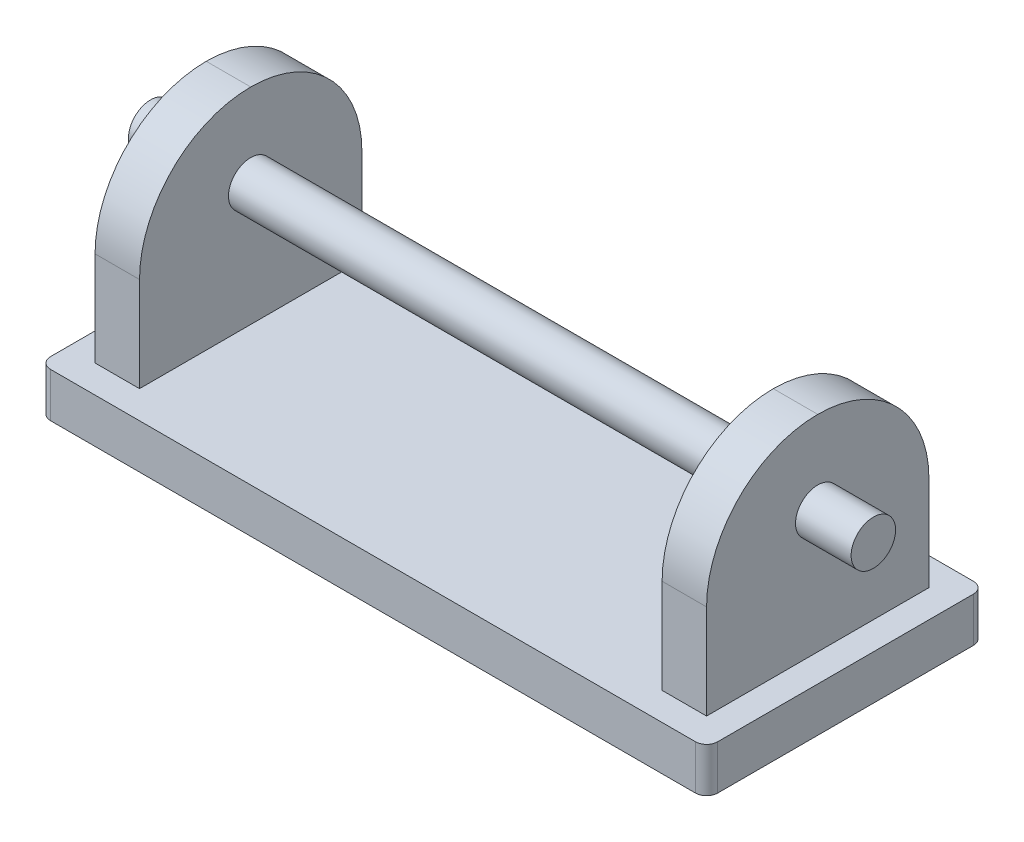
ISO-10303-21;
HEADER;
FILE_DESCRIPTION(('STEP AP214'),'2;1');
FILE_NAME('part.step','',(''),(''),'','','');
FILE_SCHEMA(('AUTOMOTIVE_DESIGN { 1 0 10303 214 1 1 1 1 }'));
ENDSEC;
DATA;
#1=APPLICATION_CONTEXT('core data for automotive mechanical design processes');
#2=APPLICATION_PROTOCOL_DEFINITION('international standard','automotive_design',2000,#1);
#3=PRODUCT_CONTEXT('',#1,'mechanical');
#4=PRODUCT('Part','Part','',(#3));
#5=PRODUCT_RELATED_PRODUCT_CATEGORY('part','',(#4));
#6=PRODUCT_DEFINITION_FORMATION('','',#4);
#7=PRODUCT_DEFINITION_CONTEXT('part definition',#1,'design');
#8=PRODUCT_DEFINITION('design','',#6,#7);
#9=PRODUCT_DEFINITION_SHAPE('','',#8);
#10=(LENGTH_UNIT() NAMED_UNIT(*) SI_UNIT(.MILLI.,.METRE.));
#11=(NAMED_UNIT(*) PLANE_ANGLE_UNIT() SI_UNIT($,.RADIAN.));
#12=(NAMED_UNIT(*) SI_UNIT($,.STERADIAN.) SOLID_ANGLE_UNIT());
#13=UNCERTAINTY_MEASURE_WITH_UNIT(LENGTH_MEASURE(1.E-05),#10,'distance_accuracy_value','');
#14=(GEOMETRIC_REPRESENTATION_CONTEXT(3) GLOBAL_UNCERTAINTY_ASSIGNED_CONTEXT((#13)) GLOBAL_UNIT_ASSIGNED_CONTEXT((#10,
#11,#12)) REPRESENTATION_CONTEXT('',''));
#15=CARTESIAN_POINT('',(0.,0.,0.));
#16=DIRECTION('',(0.,0.,1.));
#17=DIRECTION('',(1.,0.,0.));
#18=AXIS2_PLACEMENT_3D('',#15,#16,#17);
#19=CARTESIAN_POINT('',(0.,8.,0.));
#20=DIRECTION('',(0.,1.,0.));
#21=DIRECTION('',(0.,0.,1.));
#22=AXIS2_PLACEMENT_3D('',#19,#20,#21);
#23=PLANE('',#22);
#24=DIRECTION('',(0.,0.,1.));
#25=VECTOR('',#24,1.);
#26=CARTESIAN_POINT('',(-60.,8.,25.));
#27=LINE('',#26,#25);
#28=CARTESIAN_POINT('',(-60.,8.,-23.));
#29=VERTEX_POINT('',#28);
#30=CARTESIAN_POINT('',(-60.,8.,23.));
#31=VERTEX_POINT('',#30);
#32=EDGE_CURVE('E215',#29,#31,#27,.T.);
#33=ORIENTED_EDGE('',*,*,#32,.T.);
#34=CARTESIAN_POINT('',(-58.,8.,23.));
#35=DIRECTION('',(0.,1.,0.));
#36=DIRECTION('',(0.,0.,1.));
#37=AXIS2_PLACEMENT_3D('',#34,#35,#36);
#38=CIRCLE('',#37,2.);
#39=CARTESIAN_POINT('',(-58.,8.,25.));
#40=VERTEX_POINT('',#39);
#41=EDGE_CURVE('E293',#31,#40,#38,.T.);
#42=ORIENTED_EDGE('',*,*,#41,.T.);
#43=DIRECTION('',(1.,0.,0.));
#44=VECTOR('',#43,1.);
#45=CARTESIAN_POINT('',(60.,8.,25.));
#46=LINE('',#45,#44);
#47=CARTESIAN_POINT('',(58.,8.,25.));
#48=VERTEX_POINT('',#47);
#49=EDGE_CURVE('E218',#40,#48,#46,.T.);
#50=ORIENTED_EDGE('',*,*,#49,.T.);
#51=CARTESIAN_POINT('',(58.,8.,23.));
#52=DIRECTION('',(0.,1.,0.));
#53=DIRECTION('',(0.,0.,1.));
#54=AXIS2_PLACEMENT_3D('',#51,#52,#53);
#55=CIRCLE('',#54,2.);
#56=CARTESIAN_POINT('',(60.,8.,23.));
#57=VERTEX_POINT('',#56);
#58=EDGE_CURVE('E288',#48,#57,#55,.T.);
#59=ORIENTED_EDGE('',*,*,#58,.T.);
#60=DIRECTION('',(0.,0.,-1.));
#61=VECTOR('',#60,1.);
#62=CARTESIAN_POINT('',(60.,8.,25.));
#63=LINE('',#62,#61);
#64=CARTESIAN_POINT('',(60.,8.,-23.));
#65=VERTEX_POINT('',#64);
#66=EDGE_CURVE('E222',#57,#65,#63,.T.);
#67=ORIENTED_EDGE('',*,*,#66,.T.);
#68=CARTESIAN_POINT('',(58.,8.,-23.));
#69=DIRECTION('',(0.,1.,0.));
#70=DIRECTION('',(0.,0.,1.));
#71=AXIS2_PLACEMENT_3D('',#68,#69,#70);
#72=CIRCLE('',#71,2.);
#73=CARTESIAN_POINT('',(58.,8.,-25.));
#74=VERTEX_POINT('',#73);
#75=EDGE_CURVE('E55',#65,#74,#72,.T.);
#76=ORIENTED_EDGE('',*,*,#75,.T.);
#77=DIRECTION('',(-1.,0.,0.));
#78=VECTOR('',#77,1.);
#79=CARTESIAN_POINT('',(60.,8.,-25.));
#80=LINE('',#79,#78);
#81=CARTESIAN_POINT('',(-58.,8.,-25.));
#82=VERTEX_POINT('',#81);
#83=EDGE_CURVE('E224',#74,#82,#80,.T.);
#84=ORIENTED_EDGE('',*,*,#83,.T.);
#85=CARTESIAN_POINT('',(-58.,8.,-23.));
#86=DIRECTION('',(0.,1.,0.));
#87=DIRECTION('',(0.,0.,1.));
#88=AXIS2_PLACEMENT_3D('',#85,#86,#87);
#89=CIRCLE('',#88,2.);
#90=EDGE_CURVE('E291',#82,#29,#89,.T.);
#91=ORIENTED_EDGE('',*,*,#90,.T.);
#92=EDGE_LOOP('',(#33,#42,#50,#59,#67,#76,#84,#91));
#93=FACE_BOUND('',#92,.T.);
#94=DIRECTION('',(-1.,0.,0.));
#95=VECTOR('',#94,1.);
#96=CARTESIAN_POINT('',(-55.,8.,-20.));
#97=LINE('',#96,#95);
#98=CARTESIAN_POINT('',(-47.,8.,-20.));
#99=VERTEX_POINT('',#98);
#100=CARTESIAN_POINT('',(-55.,8.,-20.));
#101=VERTEX_POINT('',#100);
#102=EDGE_CURVE('E197',#99,#101,#97,.T.);
#103=ORIENTED_EDGE('',*,*,#102,.F.);
#104=DIRECTION('',(0.,0.,-1.));
#105=VECTOR('',#104,1.);
#106=CARTESIAN_POINT('',(-47.,8.,-20.));
#107=LINE('',#106,#105);
#108=CARTESIAN_POINT('',(-47.,8.,20.));
#109=VERTEX_POINT('',#108);
#110=EDGE_CURVE('E170',#109,#99,#107,.T.);
#111=ORIENTED_EDGE('',*,*,#110,.F.);
#112=DIRECTION('',(1.,0.,0.));
#113=VECTOR('',#112,1.);
#114=CARTESIAN_POINT('',(-55.,8.,20.));
#115=LINE('',#114,#113);
#116=CARTESIAN_POINT('',(-55.,8.,20.));
#117=VERTEX_POINT('',#116);
#118=EDGE_CURVE('E203',#117,#109,#115,.T.);
#119=ORIENTED_EDGE('',*,*,#118,.F.);
#120=DIRECTION('',(0.,0.,1.));
#121=VECTOR('',#120,1.);
#122=CARTESIAN_POINT('',(-55.,8.,-20.));
#123=LINE('',#122,#121);
#124=EDGE_CURVE('E200',#101,#117,#123,.T.);
#125=ORIENTED_EDGE('',*,*,#124,.F.);
#126=EDGE_LOOP('',(#103,#111,#119,#125));
#127=FACE_BOUND('',#126,.T.);
#128=DIRECTION('',(-1.,0.,0.));
#129=VECTOR('',#128,1.);
#130=CARTESIAN_POINT('',(47.,8.,-20.));
#131=LINE('',#130,#129);
#132=CARTESIAN_POINT('',(55.,8.,-20.));
#133=VERTEX_POINT('',#132);
#134=CARTESIAN_POINT('',(47.,8.,-20.));
#135=VERTEX_POINT('',#134);
#136=EDGE_CURVE('E165',#133,#135,#131,.T.);
#137=ORIENTED_EDGE('',*,*,#136,.F.);
#138=DIRECTION('',(0.,0.,-1.));
#139=VECTOR('',#138,1.);
#140=CARTESIAN_POINT('',(55.,8.,-20.));
#141=LINE('',#140,#139);
#142=CARTESIAN_POINT('',(55.,8.,20.));
#143=VERTEX_POINT('',#142);
#144=EDGE_CURVE('E174',#143,#133,#141,.T.);
#145=ORIENTED_EDGE('',*,*,#144,.F.);
#146=DIRECTION('',(1.,0.,0.));
#147=VECTOR('',#146,1.);
#148=CARTESIAN_POINT('',(47.,8.,20.));
#149=LINE('',#148,#147);
#150=CARTESIAN_POINT('',(47.,8.,20.));
#151=VERTEX_POINT('',#150);
#152=EDGE_CURVE('E186',#151,#143,#149,.T.);
#153=ORIENTED_EDGE('',*,*,#152,.F.);
#154=DIRECTION('',(0.,0.,1.));
#155=VECTOR('',#154,1.);
#156=CARTESIAN_POINT('',(47.,8.,-20.));
#157=LINE('',#156,#155);
#158=EDGE_CURVE('E184',#135,#151,#157,.T.);
#159=ORIENTED_EDGE('',*,*,#158,.F.);
#160=EDGE_LOOP('',(#137,#145,#153,#159));
#161=FACE_BOUND('',#160,.T.);
#162=ADVANCED_FACE('F33',(#93,#127,#161),#23,.T.);
#163=CARTESIAN_POINT('',(-60.,8.,25.));
#164=DIRECTION('',(1.,0.,0.));
#165=DIRECTION('',(0.,0.,-1.));
#166=AXIS2_PLACEMENT_3D('',#163,#164,#165);
#167=PLANE('',#166);
#168=DIRECTION('',(0.,0.,1.));
#169=VECTOR('',#168,1.);
#170=CARTESIAN_POINT('',(-60.,0.,25.));
#171=LINE('',#170,#169);
#172=CARTESIAN_POINT('',(-60.,0.,-23.));
#173=VERTEX_POINT('',#172);
#174=CARTESIAN_POINT('',(-60.,0.,23.));
#175=VERTEX_POINT('',#174);
#176=EDGE_CURVE('E214',#173,#175,#171,.T.);
#177=ORIENTED_EDGE('',*,*,#176,.T.);
#178=DIRECTION('',(0.,-1.,0.));
#179=VECTOR('',#178,1.);
#180=CARTESIAN_POINT('',(-60.,8.,23.));
#181=LINE('',#180,#179);
#182=EDGE_CURVE('E286',#175,#31,#181,.F.);
#183=ORIENTED_EDGE('',*,*,#182,.T.);
#184=ORIENTED_EDGE('',*,*,#32,.F.);
#185=DIRECTION('',(0.,-1.,0.));
#186=VECTOR('',#185,1.);
#187=CARTESIAN_POINT('',(-60.,8.,-23.));
#188=LINE('',#187,#186);
#189=EDGE_CURVE('E283',#29,#173,#188,.T.);
#190=ORIENTED_EDGE('',*,*,#189,.T.);
#191=EDGE_LOOP('',(#177,#183,#184,#190));
#192=FACE_BOUND('',#191,.T.);
#193=ADVANCED_FACE('F323',(#192),#167,.F.);
#194=CARTESIAN_POINT('',(60.,8.,25.));
#195=DIRECTION('',(0.,0.,-1.));
#196=DIRECTION('',(-1.,0.,0.));
#197=AXIS2_PLACEMENT_3D('',#194,#195,#196);
#198=PLANE('',#197);
#199=ORIENTED_EDGE('',*,*,#49,.F.);
#200=DIRECTION('',(0.,-1.,0.));
#201=VECTOR('',#200,1.);
#202=CARTESIAN_POINT('',(-58.,8.,25.));
#203=LINE('',#202,#201);
#204=CARTESIAN_POINT('',(-58.,0.,25.));
#205=VERTEX_POINT('',#204);
#206=EDGE_CURVE('E272',#40,#205,#203,.T.);
#207=ORIENTED_EDGE('',*,*,#206,.T.);
#208=DIRECTION('',(1.,0.,0.));
#209=VECTOR('',#208,1.);
#210=CARTESIAN_POINT('',(60.,0.,25.));
#211=LINE('',#210,#209);
#212=CARTESIAN_POINT('',(58.,0.,25.));
#213=VERTEX_POINT('',#212);
#214=EDGE_CURVE('E229',#205,#213,#211,.T.);
#215=ORIENTED_EDGE('',*,*,#214,.T.);
#216=DIRECTION('',(0.,-1.,0.));
#217=VECTOR('',#216,1.);
#218=CARTESIAN_POINT('',(58.,8.,25.));
#219=LINE('',#218,#217);
#220=EDGE_CURVE('E259',#213,#48,#219,.F.);
#221=ORIENTED_EDGE('',*,*,#220,.T.);
#222=EDGE_LOOP('',(#199,#207,#215,#221));
#223=FACE_BOUND('',#222,.T.);
#224=ADVANCED_FACE('F331',(#223),#198,.F.);
#225=CARTESIAN_POINT('',(60.,8.,25.));
#226=DIRECTION('',(-1.,0.,0.));
#227=DIRECTION('',(0.,0.,1.));
#228=AXIS2_PLACEMENT_3D('',#225,#226,#227);
#229=PLANE('',#228);
#230=DIRECTION('',(0.,0.,-1.));
#231=VECTOR('',#230,1.);
#232=CARTESIAN_POINT('',(60.,0.,25.));
#233=LINE('',#232,#231);
#234=CARTESIAN_POINT('',(60.,0.,23.));
#235=VERTEX_POINT('',#234);
#236=CARTESIAN_POINT('',(60.,0.,-23.));
#237=VERTEX_POINT('',#236);
#238=EDGE_CURVE('E232',#235,#237,#233,.T.);
#239=ORIENTED_EDGE('',*,*,#238,.T.);
#240=DIRECTION('',(0.,-1.,0.));
#241=VECTOR('',#240,1.);
#242=CARTESIAN_POINT('',(60.,8.,-23.));
#243=LINE('',#242,#241);
#244=EDGE_CURVE('E11',#237,#65,#243,.F.);
#245=ORIENTED_EDGE('',*,*,#244,.T.);
#246=ORIENTED_EDGE('',*,*,#66,.F.);
#247=DIRECTION('',(0.,-1.,0.));
#248=VECTOR('',#247,1.);
#249=CARTESIAN_POINT('',(60.,8.,23.));
#250=LINE('',#249,#248);
#251=EDGE_CURVE('E41',#57,#235,#250,.T.);
#252=ORIENTED_EDGE('',*,*,#251,.T.);
#253=EDGE_LOOP('',(#239,#245,#246,#252));
#254=FACE_BOUND('',#253,.T.);
#255=ADVANCED_FACE('F303',(#254),#229,.F.);
#256=CARTESIAN_POINT('',(60.,8.,-25.));
#257=DIRECTION('',(0.,0.,1.));
#258=DIRECTION('',(1.,0.,0.));
#259=AXIS2_PLACEMENT_3D('',#256,#257,#258);
#260=PLANE('',#259);
#261=DIRECTION('',(-1.,0.,0.));
#262=VECTOR('',#261,1.);
#263=CARTESIAN_POINT('',(60.,0.,-25.));
#264=LINE('',#263,#262);
#265=CARTESIAN_POINT('',(58.,0.,-25.));
#266=VERTEX_POINT('',#265);
#267=CARTESIAN_POINT('',(-58.,0.,-25.));
#268=VERTEX_POINT('',#267);
#269=EDGE_CURVE('E219',#266,#268,#264,.T.);
#270=ORIENTED_EDGE('',*,*,#269,.T.);
#271=DIRECTION('',(0.,-1.,0.));
#272=VECTOR('',#271,1.);
#273=CARTESIAN_POINT('',(-58.,8.,-25.));
#274=LINE('',#273,#272);
#275=EDGE_CURVE('E48',#268,#82,#274,.F.);
#276=ORIENTED_EDGE('',*,*,#275,.T.);
#277=ORIENTED_EDGE('',*,*,#83,.F.);
#278=DIRECTION('',(0.,-1.,0.));
#279=VECTOR('',#278,1.);
#280=CARTESIAN_POINT('',(58.,8.,-25.));
#281=LINE('',#280,#279);
#282=EDGE_CURVE('E295',#74,#266,#281,.T.);
#283=ORIENTED_EDGE('',*,*,#282,.T.);
#284=EDGE_LOOP('',(#270,#276,#277,#283));
#285=FACE_BOUND('',#284,.T.);
#286=ADVANCED_FACE('F314',(#285),#260,.F.);
#287=CARTESIAN_POINT('',(0.,0.,0.));
#288=DIRECTION('',(0.,1.,0.));
#289=DIRECTION('',(0.,0.,1.));
#290=AXIS2_PLACEMENT_3D('',#287,#288,#289);
#291=PLANE('',#290);
#292=ORIENTED_EDGE('',*,*,#214,.F.);
#293=CARTESIAN_POINT('',(-58.,0.,23.));
#294=DIRECTION('',(0.,1.,0.));
#295=DIRECTION('',(0.,0.,1.));
#296=AXIS2_PLACEMENT_3D('',#293,#294,#295);
#297=CIRCLE('',#296,2.);
#298=EDGE_CURVE('E281',#205,#175,#297,.F.);
#299=ORIENTED_EDGE('',*,*,#298,.T.);
#300=ORIENTED_EDGE('',*,*,#176,.F.);
#301=CARTESIAN_POINT('',(-58.,0.,-23.));
#302=DIRECTION('',(0.,1.,0.));
#303=DIRECTION('',(0.,0.,1.));
#304=AXIS2_PLACEMENT_3D('',#301,#302,#303);
#305=CIRCLE('',#304,2.);
#306=EDGE_CURVE('E279',#173,#268,#305,.F.);
#307=ORIENTED_EDGE('',*,*,#306,.T.);
#308=ORIENTED_EDGE('',*,*,#269,.F.);
#309=CARTESIAN_POINT('',(58.,0.,-23.));
#310=DIRECTION('',(0.,1.,0.));
#311=DIRECTION('',(0.,0.,1.));
#312=AXIS2_PLACEMENT_3D('',#309,#310,#311);
#313=CIRCLE('',#312,2.);
#314=EDGE_CURVE('E277',#266,#237,#313,.F.);
#315=ORIENTED_EDGE('',*,*,#314,.T.);
#316=ORIENTED_EDGE('',*,*,#238,.F.);
#317=CARTESIAN_POINT('',(58.,0.,23.));
#318=DIRECTION('',(0.,1.,0.));
#319=DIRECTION('',(0.,0.,1.));
#320=AXIS2_PLACEMENT_3D('',#317,#318,#319);
#321=CIRCLE('',#320,2.);
#322=EDGE_CURVE('E275',#235,#213,#321,.F.);
#323=ORIENTED_EDGE('',*,*,#322,.T.);
#324=EDGE_LOOP('',(#292,#299,#300,#307,#308,#315,#316,#323));
#325=FACE_BOUND('',#324,.T.);
#326=ADVANCED_FACE('F309',(#325),#291,.F.);
#327=CARTESIAN_POINT('',(-47.,45.,-20.));
#328=DIRECTION('',(-1.,0.,0.));
#329=DIRECTION('',(0.,0.,1.));
#330=AXIS2_PLACEMENT_3D('',#327,#328,#329);
#331=PLANE('',#330);
#332=CARTESIAN_POINT('',(-47.,30.,0.));
#333=DIRECTION('',(-1.,0.,0.));
#334=DIRECTION('',(0.,0.,1.));
#335=AXIS2_PLACEMENT_3D('',#332,#333,#334);
#336=CIRCLE('',#335,4.);
#337=CARTESIAN_POINT('',(-47.,30.,4.00000000000002));
#338=VERTEX_POINT('',#337);
#339=EDGE_CURVE('E265',#338,#338,#336,.T.);
#340=ORIENTED_EDGE('',*,*,#339,.T.);
#341=EDGE_LOOP('',(#340));
#342=FACE_BOUND('',#341,.T.);
#343=DIRECTION('',(0.,-1.,0.));
#344=VECTOR('',#343,1.);
#345=CARTESIAN_POINT('',(-47.,45.,-20.));
#346=LINE('',#345,#344);
#347=CARTESIAN_POINT('',(-47.,25.,-20.));
#348=VERTEX_POINT('',#347);
#349=EDGE_CURVE('E212',#348,#99,#346,.T.);
#350=ORIENTED_EDGE('',*,*,#349,.F.);
#351=CARTESIAN_POINT('',(-47.,25.,0.));
#352=DIRECTION('',(-1.,0.,0.));
#353=DIRECTION('',(0.,0.,1.));
#354=AXIS2_PLACEMENT_3D('',#351,#352,#353);
#355=CIRCLE('',#354,20.);
#356=CARTESIAN_POINT('',(-47.,45.,0.));
#357=VERTEX_POINT('',#356);
#358=EDGE_CURVE('E255',#348,#357,#355,.F.);
#359=ORIENTED_EDGE('',*,*,#358,.T.);
#360=CARTESIAN_POINT('',(-47.,25.,0.));
#361=DIRECTION('',(-1.,0.,0.));
#362=DIRECTION('',(0.,0.,1.));
#363=AXIS2_PLACEMENT_3D('',#360,#361,#362);
#364=CIRCLE('',#363,20.);
#365=CARTESIAN_POINT('',(-47.,25.,20.));
#366=VERTEX_POINT('',#365);
#367=EDGE_CURVE('E253',#357,#366,#364,.F.);
#368=ORIENTED_EDGE('',*,*,#367,.T.);
#369=DIRECTION('',(0.,-1.,0.));
#370=VECTOR('',#369,1.);
#371=CARTESIAN_POINT('',(-47.,45.,20.));
#372=LINE('',#371,#370);
#373=EDGE_CURVE('E206',#366,#109,#372,.T.);
#374=ORIENTED_EDGE('',*,*,#373,.T.);
#375=ORIENTED_EDGE('',*,*,#110,.T.);
#376=EDGE_LOOP('',(#350,#359,#368,#374,#375));
#377=FACE_BOUND('',#376,.T.);
#378=ADVANCED_FACE('F345',(#342,#377),#331,.F.);
#379=CARTESIAN_POINT('',(-55.,45.,-20.));
#380=DIRECTION('',(0.,0.,1.));
#381=DIRECTION('',(1.,0.,0.));
#382=AXIS2_PLACEMENT_3D('',#379,#380,#381);
#383=PLANE('',#382);
#384=DIRECTION('',(0.,-1.,0.));
#385=VECTOR('',#384,1.);
#386=CARTESIAN_POINT('',(-55.,45.,-20.));
#387=LINE('',#386,#385);
#388=CARTESIAN_POINT('',(-55.,25.,-20.));
#389=VERTEX_POINT('',#388);
#390=EDGE_CURVE('E210',#389,#101,#387,.T.);
#391=ORIENTED_EDGE('',*,*,#390,.F.);
#392=DIRECTION('',(-1.,0.,0.));
#393=VECTOR('',#392,1.);
#394=CARTESIAN_POINT('',(-47.,25.,-20.));
#395=LINE('',#394,#393);
#396=EDGE_CURVE('E250',#389,#348,#395,.F.);
#397=ORIENTED_EDGE('',*,*,#396,.T.);
#398=ORIENTED_EDGE('',*,*,#349,.T.);
#399=ORIENTED_EDGE('',*,*,#102,.T.);
#400=EDGE_LOOP('',(#391,#397,#398,#399));
#401=FACE_BOUND('',#400,.T.);
#402=ADVANCED_FACE('F511',(#401),#383,.F.);
#403=CARTESIAN_POINT('',(-55.,45.,-20.));
#404=DIRECTION('',(1.,0.,0.));
#405=DIRECTION('',(0.,0.,-1.));
#406=AXIS2_PLACEMENT_3D('',#403,#404,#405);
#407=PLANE('',#406);
#408=CARTESIAN_POINT('',(-55.,30.,0.));
#409=DIRECTION('',(1.,0.,0.));
#410=DIRECTION('',(0.,0.,-1.));
#411=AXIS2_PLACEMENT_3D('',#408,#409,#410);
#412=CIRCLE('',#411,4.);
#413=CARTESIAN_POINT('',(-55.,30.,-3.99999999999998));
#414=VERTEX_POINT('',#413);
#415=EDGE_CURVE('E595',#414,#414,#412,.T.);
#416=ORIENTED_EDGE('',*,*,#415,.T.);
#417=EDGE_LOOP('',(#416));
#418=FACE_BOUND('',#417,.T.);
#419=CARTESIAN_POINT('',(-55.,25.,0.));
#420=DIRECTION('',(1.,0.,0.));
#421=DIRECTION('',(0.,0.,-1.));
#422=AXIS2_PLACEMENT_3D('',#419,#420,#421);
#423=CIRCLE('',#422,20.);
#424=CARTESIAN_POINT('',(-55.,25.,20.));
#425=VERTEX_POINT('',#424);
#426=CARTESIAN_POINT('',(-55.,45.,0.));
#427=VERTEX_POINT('',#426);
#428=EDGE_CURVE('E246',#425,#427,#423,.F.);
#429=ORIENTED_EDGE('',*,*,#428,.T.);
#430=CARTESIAN_POINT('',(-55.,25.,0.));
#431=DIRECTION('',(1.,0.,0.));
#432=DIRECTION('',(0.,0.,-1.));
#433=AXIS2_PLACEMENT_3D('',#430,#431,#432);
#434=CIRCLE('',#433,20.);
#435=EDGE_CURVE('E248',#427,#389,#434,.F.);
#436=ORIENTED_EDGE('',*,*,#435,.T.);
#437=ORIENTED_EDGE('',*,*,#390,.T.);
#438=ORIENTED_EDGE('',*,*,#124,.T.);
#439=DIRECTION('',(0.,-1.,0.));
#440=VECTOR('',#439,1.);
#441=CARTESIAN_POINT('',(-55.,45.,20.));
#442=LINE('',#441,#440);
#443=EDGE_CURVE('E208',#425,#117,#442,.T.);
#444=ORIENTED_EDGE('',*,*,#443,.F.);
#445=EDGE_LOOP('',(#429,#436,#437,#438,#444));
#446=FACE_BOUND('',#445,.T.);
#447=ADVANCED_FACE('F502',(#418,#446),#407,.F.);
#448=CARTESIAN_POINT('',(-55.,45.,20.));
#449=DIRECTION('',(0.,0.,-1.));
#450=DIRECTION('',(-1.,0.,0.));
#451=AXIS2_PLACEMENT_3D('',#448,#449,#450);
#452=PLANE('',#451);
#453=ORIENTED_EDGE('',*,*,#373,.F.);
#454=DIRECTION('',(1.,0.,0.));
#455=VECTOR('',#454,1.);
#456=CARTESIAN_POINT('',(-55.,25.,20.));
#457=LINE('',#456,#455);
#458=EDGE_CURVE('E257',#366,#425,#457,.F.);
#459=ORIENTED_EDGE('',*,*,#458,.T.);
#460=ORIENTED_EDGE('',*,*,#443,.T.);
#461=ORIENTED_EDGE('',*,*,#118,.T.);
#462=EDGE_LOOP('',(#453,#459,#460,#461));
#463=FACE_BOUND('',#462,.T.);
#464=ADVANCED_FACE('F493',(#463),#452,.F.);
#465=CARTESIAN_POINT('',(55.,45.,-20.));
#466=DIRECTION('',(-1.,0.,0.));
#467=DIRECTION('',(0.,0.,1.));
#468=AXIS2_PLACEMENT_3D('',#465,#466,#467);
#469=PLANE('',#468);
#470=CARTESIAN_POINT('',(55.,30.,0.));
#471=DIRECTION('',(-1.,0.,0.));
#472=DIRECTION('',(0.,0.,1.));
#473=AXIS2_PLACEMENT_3D('',#470,#471,#472);
#474=CIRCLE('',#473,4.);
#475=CARTESIAN_POINT('',(55.,30.,3.99999999999998));
#476=VERTEX_POINT('',#475);
#477=EDGE_CURVE('E269',#476,#476,#474,.T.);
#478=ORIENTED_EDGE('',*,*,#477,.T.);
#479=EDGE_LOOP('',(#478));
#480=FACE_BOUND('',#479,.T.);
#481=DIRECTION('',(0.,-1.,0.));
#482=VECTOR('',#481,1.);
#483=CARTESIAN_POINT('',(55.,45.,-20.));
#484=LINE('',#483,#482);
#485=CARTESIAN_POINT('',(55.,25.,-20.));
#486=VERTEX_POINT('',#485);
#487=EDGE_CURVE('E160',#486,#133,#484,.T.);
#488=ORIENTED_EDGE('',*,*,#487,.F.);
#489=CARTESIAN_POINT('',(55.,25.,0.));
#490=DIRECTION('',(-1.,0.,0.));
#491=DIRECTION('',(0.,0.,1.));
#492=AXIS2_PLACEMENT_3D('',#489,#490,#491);
#493=CIRCLE('',#492,20.);
#494=CARTESIAN_POINT('',(55.,45.,0.));
#495=VERTEX_POINT('',#494);
#496=EDGE_CURVE('E242',#486,#495,#493,.F.);
#497=ORIENTED_EDGE('',*,*,#496,.T.);
#498=CARTESIAN_POINT('',(55.,25.,0.));
#499=DIRECTION('',(-1.,0.,0.));
#500=DIRECTION('',(0.,0.,1.));
#501=AXIS2_PLACEMENT_3D('',#498,#499,#500);
#502=CIRCLE('',#501,20.);
#503=CARTESIAN_POINT('',(55.,25.,20.));
#504=VERTEX_POINT('',#503);
#505=EDGE_CURVE('E240',#495,#504,#502,.F.);
#506=ORIENTED_EDGE('',*,*,#505,.T.);
#507=DIRECTION('',(0.,-1.,0.));
#508=VECTOR('',#507,1.);
#509=CARTESIAN_POINT('',(55.,45.,20.));
#510=LINE('',#509,#508);
#511=EDGE_CURVE('E177',#504,#143,#510,.T.);
#512=ORIENTED_EDGE('',*,*,#511,.T.);
#513=ORIENTED_EDGE('',*,*,#144,.T.);
#514=EDGE_LOOP('',(#488,#497,#506,#512,#513));
#515=FACE_BOUND('',#514,.T.);
#516=ADVANCED_FACE('F175',(#480,#515),#469,.F.);
#517=CARTESIAN_POINT('',(47.,45.,-20.));
#518=DIRECTION('',(0.,0.,1.));
#519=DIRECTION('',(1.,0.,0.));
#520=AXIS2_PLACEMENT_3D('',#517,#518,#519);
#521=PLANE('',#520);
#522=DIRECTION('',(0.,-1.,0.));
#523=VECTOR('',#522,1.);
#524=CARTESIAN_POINT('',(47.,45.,-20.));
#525=LINE('',#524,#523);
#526=CARTESIAN_POINT('',(47.,25.,-20.));
#527=VERTEX_POINT('',#526);
#528=EDGE_CURVE('E171',#527,#135,#525,.T.);
#529=ORIENTED_EDGE('',*,*,#528,.F.);
#530=DIRECTION('',(-1.,0.,0.));
#531=VECTOR('',#530,1.);
#532=CARTESIAN_POINT('',(55.,25.,-20.));
#533=LINE('',#532,#531);
#534=EDGE_CURVE('E168',#527,#486,#533,.F.);
#535=ORIENTED_EDGE('',*,*,#534,.T.);
#536=ORIENTED_EDGE('',*,*,#487,.T.);
#537=ORIENTED_EDGE('',*,*,#136,.T.);
#538=EDGE_LOOP('',(#529,#535,#536,#537));
#539=FACE_BOUND('',#538,.T.);
#540=ADVANCED_FACE('F163',(#539),#521,.F.);
#541=CARTESIAN_POINT('',(47.,45.,-20.));
#542=DIRECTION('',(1.,0.,0.));
#543=DIRECTION('',(0.,0.,-1.));
#544=AXIS2_PLACEMENT_3D('',#541,#542,#543);
#545=PLANE('',#544);
#546=CARTESIAN_POINT('',(47.,30.,0.));
#547=DIRECTION('',(1.,0.,0.));
#548=DIRECTION('',(0.,0.,-1.));
#549=AXIS2_PLACEMENT_3D('',#546,#547,#548);
#550=CIRCLE('',#549,4.);
#551=CARTESIAN_POINT('',(47.,30.,-4.00000000000002));
#552=VERTEX_POINT('',#551);
#553=EDGE_CURVE('E266',#552,#552,#550,.T.);
#554=ORIENTED_EDGE('',*,*,#553,.T.);
#555=EDGE_LOOP('',(#554));
#556=FACE_BOUND('',#555,.T.);
#557=CARTESIAN_POINT('',(47.,25.,0.));
#558=DIRECTION('',(1.,0.,0.));
#559=DIRECTION('',(0.,0.,-1.));
#560=AXIS2_PLACEMENT_3D('',#557,#558,#559);
#561=CIRCLE('',#560,20.);
#562=CARTESIAN_POINT('',(47.,25.,20.));
#563=VERTEX_POINT('',#562);
#564=CARTESIAN_POINT('',(47.,45.,0.));
#565=VERTEX_POINT('',#564);
#566=EDGE_CURVE('E226',#563,#565,#561,.F.);
#567=ORIENTED_EDGE('',*,*,#566,.T.);
#568=CARTESIAN_POINT('',(47.,25.,0.));
#569=DIRECTION('',(1.,0.,0.));
#570=DIRECTION('',(0.,0.,-1.));
#571=AXIS2_PLACEMENT_3D('',#568,#569,#570);
#572=CIRCLE('',#571,20.);
#573=EDGE_CURVE('E237',#565,#527,#572,.F.);
#574=ORIENTED_EDGE('',*,*,#573,.T.);
#575=ORIENTED_EDGE('',*,*,#528,.T.);
#576=ORIENTED_EDGE('',*,*,#158,.T.);
#577=DIRECTION('',(0.,-1.,0.));
#578=VECTOR('',#577,1.);
#579=CARTESIAN_POINT('',(47.,45.,20.));
#580=LINE('',#579,#578);
#581=EDGE_CURVE('E192',#563,#151,#580,.T.);
#582=ORIENTED_EDGE('',*,*,#581,.F.);
#583=EDGE_LOOP('',(#567,#574,#575,#576,#582));
#584=FACE_BOUND('',#583,.T.);
#585=ADVANCED_FACE('F469',(#556,#584),#545,.F.);
#586=CARTESIAN_POINT('',(47.,45.,20.));
#587=DIRECTION('',(0.,0.,-1.));
#588=DIRECTION('',(-1.,0.,0.));
#589=AXIS2_PLACEMENT_3D('',#586,#587,#588);
#590=PLANE('',#589);
#591=ORIENTED_EDGE('',*,*,#511,.F.);
#592=DIRECTION('',(1.,0.,0.));
#593=VECTOR('',#592,1.);
#594=CARTESIAN_POINT('',(47.,25.,20.));
#595=LINE('',#594,#593);
#596=EDGE_CURVE('E244',#504,#563,#595,.F.);
#597=ORIENTED_EDGE('',*,*,#596,.T.);
#598=ORIENTED_EDGE('',*,*,#581,.T.);
#599=ORIENTED_EDGE('',*,*,#152,.T.);
#600=EDGE_LOOP('',(#591,#597,#598,#599));
#601=FACE_BOUND('',#600,.T.);
#602=ADVANCED_FACE('F363',(#601),#590,.F.);
#603=CARTESIAN_POINT('',(0.,25.,0.));
#604=DIRECTION('',(-1.,0.,0.));
#605=DIRECTION('',(0.,0.,1.));
#606=AXIS2_PLACEMENT_3D('',#603,#604,#605);
#607=CYLINDRICAL_SURFACE('',#606,20.);
#608=ORIENTED_EDGE('',*,*,#596,.F.);
#609=ORIENTED_EDGE('',*,*,#505,.F.);
#610=DIRECTION('',(1.,0.,0.));
#611=VECTOR('',#610,1.);
#612=CARTESIAN_POINT('',(55.,45.,0.));
#613=LINE('',#612,#611);
#614=EDGE_CURVE('E181',#565,#495,#613,.T.);
#615=ORIENTED_EDGE('',*,*,#614,.F.);
#616=ORIENTED_EDGE('',*,*,#566,.F.);
#617=EDGE_LOOP('',(#608,#609,#615,#616));
#618=FACE_BOUND('',#617,.T.);
#619=ADVANCED_FACE('F359',(#618),#607,.T.);
#620=CARTESIAN_POINT('',(0.,25.,0.));
#621=DIRECTION('',(1.,0.,0.));
#622=DIRECTION('',(0.,0.,-1.));
#623=AXIS2_PLACEMENT_3D('',#620,#621,#622);
#624=CYLINDRICAL_SURFACE('',#623,20.);
#625=ORIENTED_EDGE('',*,*,#496,.F.);
#626=ORIENTED_EDGE('',*,*,#534,.F.);
#627=ORIENTED_EDGE('',*,*,#573,.F.);
#628=ORIENTED_EDGE('',*,*,#614,.T.);
#629=EDGE_LOOP('',(#625,#626,#627,#628));
#630=FACE_BOUND('',#629,.T.);
#631=ADVANCED_FACE('F355',(#630),#624,.T.);
#632=CARTESIAN_POINT('',(0.,25.,0.));
#633=DIRECTION('',(-1.,0.,0.));
#634=DIRECTION('',(0.,0.,1.));
#635=AXIS2_PLACEMENT_3D('',#632,#633,#634);
#636=CYLINDRICAL_SURFACE('',#635,20.);
#637=ORIENTED_EDGE('',*,*,#458,.F.);
#638=ORIENTED_EDGE('',*,*,#367,.F.);
#639=DIRECTION('',(1.,0.,0.));
#640=VECTOR('',#639,1.);
#641=CARTESIAN_POINT('',(-47.,45.,0.));
#642=LINE('',#641,#640);
#643=EDGE_CURVE('E262',#427,#357,#642,.T.);
#644=ORIENTED_EDGE('',*,*,#643,.F.);
#645=ORIENTED_EDGE('',*,*,#428,.F.);
#646=EDGE_LOOP('',(#637,#638,#644,#645));
#647=FACE_BOUND('',#646,.T.);
#648=ADVANCED_FACE('F358',(#647),#636,.T.);
#649=CARTESIAN_POINT('',(0.,25.,0.));
#650=DIRECTION('',(1.,0.,0.));
#651=DIRECTION('',(0.,0.,-1.));
#652=AXIS2_PLACEMENT_3D('',#649,#650,#651);
#653=CYLINDRICAL_SURFACE('',#652,20.);
#654=ORIENTED_EDGE('',*,*,#358,.F.);
#655=ORIENTED_EDGE('',*,*,#396,.F.);
#656=ORIENTED_EDGE('',*,*,#435,.F.);
#657=ORIENTED_EDGE('',*,*,#643,.T.);
#658=EDGE_LOOP('',(#654,#655,#656,#657));
#659=FACE_BOUND('',#658,.T.);
#660=ADVANCED_FACE('F365',(#659),#653,.T.);
#661=CARTESIAN_POINT('',(65.,30.,0.));
#662=DIRECTION('',(-1.,0.,0.));
#663=DIRECTION('',(0.,0.,1.));
#664=AXIS2_PLACEMENT_3D('',#661,#662,#663);
#665=CYLINDRICAL_SURFACE('',#664,4.);
#666=ORIENTED_EDGE('',*,*,#553,.F.);
#667=EDGE_LOOP('',(#666));
#668=FACE_BOUND('',#667,.T.);
#669=ORIENTED_EDGE('',*,*,#339,.F.);
#670=EDGE_LOOP('',(#669));
#671=FACE_BOUND('',#670,.T.);
#672=ADVANCED_FACE('F368',(#668,#671),#665,.T.);
#673=CARTESIAN_POINT('',(65.,30.,0.));
#674=DIRECTION('',(-1.,0.,0.));
#675=DIRECTION('',(0.,0.,1.));
#676=AXIS2_PLACEMENT_3D('',#673,#674,#675);
#677=PLANE('',#676);
#678=CARTESIAN_POINT('',(65.,30.,0.));
#679=DIRECTION('',(-1.,0.,0.));
#680=DIRECTION('',(0.,0.,1.));
#681=AXIS2_PLACEMENT_3D('',#678,#679,#680);
#682=CIRCLE('',#681,4.);
#683=CARTESIAN_POINT('',(65.,30.,3.99999999999998));
#684=VERTEX_POINT('',#683);
#685=EDGE_CURVE('E270',#684,#684,#682,.T.);
#686=ORIENTED_EDGE('',*,*,#685,.F.);
#687=EDGE_LOOP('',(#686));
#688=FACE_BOUND('',#687,.T.);
#689=ADVANCED_FACE('F424',(#688),#677,.F.);
#690=ORIENTED_EDGE('',*,*,#685,.T.);
#691=EDGE_LOOP('',(#690));
#692=FACE_BOUND('',#691,.T.);
#693=ORIENTED_EDGE('',*,*,#477,.F.);
#694=EDGE_LOOP('',(#693));
#695=FACE_BOUND('',#694,.T.);
#696=ADVANCED_FACE('F415',(#692,#695),#665,.T.);
#697=CARTESIAN_POINT('',(-65.,30.,0.));
#698=DIRECTION('',(-1.,0.,0.));
#699=DIRECTION('',(0.,0.,1.));
#700=AXIS2_PLACEMENT_3D('',#697,#698,#699);
#701=CIRCLE('',#700,4.);
#702=CARTESIAN_POINT('',(-65.,30.,4.00000000000002));
#703=VERTEX_POINT('',#702);
#704=EDGE_CURVE('E603',#703,#703,#701,.T.);
#705=ORIENTED_EDGE('',*,*,#704,.F.);
#706=EDGE_LOOP('',(#705));
#707=FACE_BOUND('',#706,.T.);
#708=ORIENTED_EDGE('',*,*,#415,.F.);
#709=EDGE_LOOP('',(#708));
#710=FACE_BOUND('',#709,.T.);
#711=ADVANCED_FACE('F406',(#707,#710),#665,.T.);
#712=CARTESIAN_POINT('',(-65.,30.,0.));
#713=DIRECTION('',(-1.,0.,0.));
#714=DIRECTION('',(0.,0.,1.));
#715=AXIS2_PLACEMENT_3D('',#712,#713,#714);
#716=PLANE('',#715);
#717=ORIENTED_EDGE('',*,*,#704,.T.);
#718=EDGE_LOOP('',(#717));
#719=FACE_BOUND('',#718,.T.);
#720=ADVANCED_FACE('F375',(#719),#716,.T.);
#721=CARTESIAN_POINT('',(-58.,8.,23.));
#722=DIRECTION('',(0.,-1.,0.));
#723=DIRECTION('',(0.,0.,-1.));
#724=AXIS2_PLACEMENT_3D('',#721,#722,#723);
#725=CYLINDRICAL_SURFACE('',#724,2.);
#726=ORIENTED_EDGE('',*,*,#41,.F.);
#727=ORIENTED_EDGE('',*,*,#182,.F.);
#728=ORIENTED_EDGE('',*,*,#298,.F.);
#729=ORIENTED_EDGE('',*,*,#206,.F.);
#730=EDGE_LOOP('',(#726,#727,#728,#729));
#731=FACE_BOUND('',#730,.T.);
#732=ADVANCED_FACE('F328',(#731),#725,.T.);
#733=CARTESIAN_POINT('',(-58.,8.,-23.));
#734=DIRECTION('',(0.,-1.,0.));
#735=DIRECTION('',(0.,0.,-1.));
#736=AXIS2_PLACEMENT_3D('',#733,#734,#735);
#737=CYLINDRICAL_SURFACE('',#736,2.);
#738=ORIENTED_EDGE('',*,*,#90,.F.);
#739=ORIENTED_EDGE('',*,*,#275,.F.);
#740=ORIENTED_EDGE('',*,*,#306,.F.);
#741=ORIENTED_EDGE('',*,*,#189,.F.);
#742=EDGE_LOOP('',(#738,#739,#740,#741));
#743=FACE_BOUND('',#742,.T.);
#744=ADVANCED_FACE('F320',(#743),#737,.T.);
#745=CARTESIAN_POINT('',(58.,8.,-23.));
#746=DIRECTION('',(0.,-1.,0.));
#747=DIRECTION('',(0.,0.,-1.));
#748=AXIS2_PLACEMENT_3D('',#745,#746,#747);
#749=CYLINDRICAL_SURFACE('',#748,2.);
#750=ORIENTED_EDGE('',*,*,#75,.F.);
#751=ORIENTED_EDGE('',*,*,#244,.F.);
#752=ORIENTED_EDGE('',*,*,#314,.F.);
#753=ORIENTED_EDGE('',*,*,#282,.F.);
#754=EDGE_LOOP('',(#750,#751,#752,#753));
#755=FACE_BOUND('',#754,.T.);
#756=ADVANCED_FACE('F313',(#755),#749,.T.);
#757=CARTESIAN_POINT('',(58.,8.,23.));
#758=DIRECTION('',(0.,-1.,0.));
#759=DIRECTION('',(0.,0.,-1.));
#760=AXIS2_PLACEMENT_3D('',#757,#758,#759);
#761=CYLINDRICAL_SURFACE('',#760,2.);
#762=ORIENTED_EDGE('',*,*,#58,.F.);
#763=ORIENTED_EDGE('',*,*,#220,.F.);
#764=ORIENTED_EDGE('',*,*,#322,.F.);
#765=ORIENTED_EDGE('',*,*,#251,.F.);
#766=EDGE_LOOP('',(#762,#763,#764,#765));
#767=FACE_BOUND('',#766,.T.);
#768=ADVANCED_FACE('F35',(#767),#761,.T.);
#769=CLOSED_SHELL('',(#162,#193,#224,#255,#286,#326,#378,#402,#447,#464,#516,#540,#585,#602,
#619,#631,#648,#660,#672,#689,#696,#711,#720,#732,#744,#756,#768));
#770=MANIFOLD_SOLID_BREP('B2',#769);
#771=ADVANCED_BREP_SHAPE_REPRESENTATION('',(#18,#770),#14);
#772=SHAPE_DEFINITION_REPRESENTATION(#9,#771);
ENDSEC;
END-ISO-10303-21;
